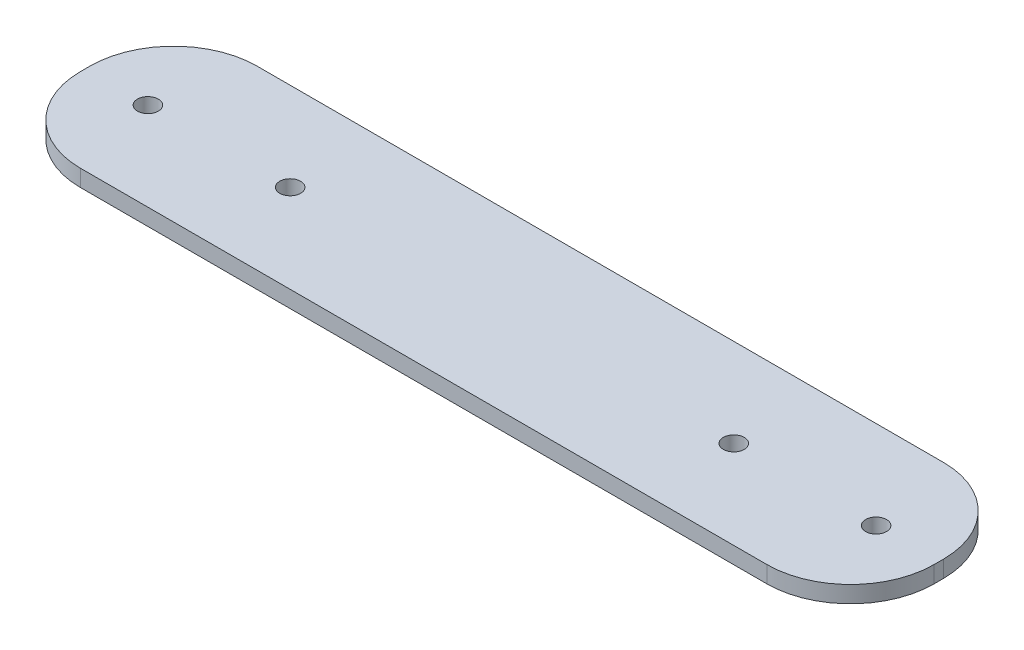
ISO-10303-21;
HEADER;
FILE_DESCRIPTION(('STEP AP214'),'2;1');
FILE_NAME('part.step','',(''),(''),'','','');
FILE_SCHEMA(('AUTOMOTIVE_DESIGN { 1 0 10303 214 1 1 1 1 }'));
ENDSEC;
DATA;
#1=APPLICATION_CONTEXT('core data for automotive mechanical design processes');
#2=APPLICATION_PROTOCOL_DEFINITION('international standard','automotive_design',2000,#1);
#3=PRODUCT_CONTEXT('',#1,'mechanical');
#4=PRODUCT('Part','Part','',(#3));
#5=PRODUCT_RELATED_PRODUCT_CATEGORY('part','',(#4));
#6=PRODUCT_DEFINITION_FORMATION('','',#4);
#7=PRODUCT_DEFINITION_CONTEXT('part definition',#1,'design');
#8=PRODUCT_DEFINITION('design','',#6,#7);
#9=PRODUCT_DEFINITION_SHAPE('','',#8);
#10=(LENGTH_UNIT() NAMED_UNIT(*) SI_UNIT(.MILLI.,.METRE.));
#11=(NAMED_UNIT(*) PLANE_ANGLE_UNIT() SI_UNIT($,.RADIAN.));
#12=(NAMED_UNIT(*) SI_UNIT($,.STERADIAN.) SOLID_ANGLE_UNIT());
#13=UNCERTAINTY_MEASURE_WITH_UNIT(LENGTH_MEASURE(1.E-05),#10,'distance_accuracy_value','');
#14=(GEOMETRIC_REPRESENTATION_CONTEXT(3) GLOBAL_UNCERTAINTY_ASSIGNED_CONTEXT((#13)) GLOBAL_UNIT_ASSIGNED_CONTEXT((#10,
#11,#12)) REPRESENTATION_CONTEXT('',''));
#15=CARTESIAN_POINT('',(0.,0.,0.));
#16=DIRECTION('',(0.,0.,1.));
#17=DIRECTION('',(1.,0.,0.));
#18=AXIS2_PLACEMENT_3D('',#15,#16,#17);
#19=CARTESIAN_POINT('',(0.,2.,0.));
#20=DIRECTION('',(0.,1.,0.));
#21=DIRECTION('',(0.,0.,1.));
#22=AXIS2_PLACEMENT_3D('',#19,#20,#21);
#23=PLANE('',#22);
#24=CARTESIAN_POINT('',(-26.5000000000001,2.,0.));
#25=DIRECTION('',(0.,1.,0.));
#26=DIRECTION('',(0.,0.,1.));
#27=AXIS2_PLACEMENT_3D('',#24,#25,#26);
#28=CIRCLE('',#27,1.25);
#29=CARTESIAN_POINT('',(-26.5000000000001,2.,1.24999999999993));
#30=VERTEX_POINT('',#29);
#31=EDGE_CURVE('E184',#30,#30,#28,.T.);
#32=ORIENTED_EDGE('',*,*,#31,.F.);
#33=EDGE_LOOP('',(#32));
#34=FACE_BOUND('',#33,.T.);
#35=CARTESIAN_POINT('',(43.5,2.,0.));
#36=DIRECTION('',(0.,1.,0.));
#37=DIRECTION('',(0.,0.,1.));
#38=AXIS2_PLACEMENT_3D('',#35,#36,#37);
#39=CIRCLE('',#38,1.24999999999999);
#40=CARTESIAN_POINT('',(43.5,2.,1.24999999999989));
#41=VERTEX_POINT('',#40);
#42=EDGE_CURVE('E168',#41,#41,#39,.T.);
#43=ORIENTED_EDGE('',*,*,#42,.F.);
#44=EDGE_LOOP('',(#43));
#45=FACE_BOUND('',#44,.T.);
#46=DIRECTION('',(0.,0.,-1.));
#47=VECTOR('',#46,1.);
#48=CARTESIAN_POINT('',(51.,2.,-10.5583756345178));
#49=LINE('',#48,#47);
#50=CARTESIAN_POINT('',(51.,2.,0.558375634517773));
#51=VERTEX_POINT('',#50);
#52=CARTESIAN_POINT('',(51.,2.,-0.558375634517773));
#53=VERTEX_POINT('',#52);
#54=EDGE_CURVE('E172',#51,#53,#49,.T.);
#55=ORIENTED_EDGE('',*,*,#54,.T.);
#56=CARTESIAN_POINT('',(41.,2.,-0.558375634517773));
#57=DIRECTION('',(0.,1.,0.));
#58=DIRECTION('',(0.,0.,1.));
#59=AXIS2_PLACEMENT_3D('',#56,#57,#58);
#60=CIRCLE('',#59,10.);
#61=CARTESIAN_POINT('',(41.,2.,-10.5583756345178));
#62=VERTEX_POINT('',#61);
#63=EDGE_CURVE('E149',#53,#62,#60,.T.);
#64=ORIENTED_EDGE('',*,*,#63,.T.);
#65=DIRECTION('',(-1.,0.,0.));
#66=VECTOR('',#65,1.);
#67=CARTESIAN_POINT('',(-51.,2.,-10.5583756345178));
#68=LINE('',#67,#66);
#69=CARTESIAN_POINT('',(-41.,2.,-10.5583756345178));
#70=VERTEX_POINT('',#69);
#71=EDGE_CURVE('E120',#62,#70,#68,.T.);
#72=ORIENTED_EDGE('',*,*,#71,.T.);
#73=CARTESIAN_POINT('',(-41.,2.,-0.558375634517773));
#74=DIRECTION('',(0.,1.,0.));
#75=DIRECTION('',(0.,0.,1.));
#76=AXIS2_PLACEMENT_3D('',#73,#74,#75);
#77=CIRCLE('',#76,10.);
#78=CARTESIAN_POINT('',(-51.,2.,-0.558375634517773));
#79=VERTEX_POINT('',#78);
#80=EDGE_CURVE('E145',#70,#79,#77,.T.);
#81=ORIENTED_EDGE('',*,*,#80,.T.);
#82=DIRECTION('',(0.,0.,1.));
#83=VECTOR('',#82,1.);
#84=CARTESIAN_POINT('',(-51.,2.,-10.5583756345178));
#85=LINE('',#84,#83);
#86=CARTESIAN_POINT('',(-51.,2.,0.558375634517773));
#87=VERTEX_POINT('',#86);
#88=EDGE_CURVE('E128',#79,#87,#85,.T.);
#89=ORIENTED_EDGE('',*,*,#88,.T.);
#90=CARTESIAN_POINT('',(-41.,2.,0.558375634517773));
#91=DIRECTION('',(0.,1.,0.));
#92=DIRECTION('',(0.,0.,1.));
#93=AXIS2_PLACEMENT_3D('',#90,#91,#92);
#94=CIRCLE('',#93,10.);
#95=CARTESIAN_POINT('',(-41.,2.,10.5583756345178));
#96=VERTEX_POINT('',#95);
#97=EDGE_CURVE('E55',#87,#96,#94,.T.);
#98=ORIENTED_EDGE('',*,*,#97,.T.);
#99=DIRECTION('',(1.,0.,0.));
#100=VECTOR('',#99,1.);
#101=CARTESIAN_POINT('',(-51.,2.,10.5583756345178));
#102=LINE('',#101,#100);
#103=CARTESIAN_POINT('',(41.,2.,10.5583756345178));
#104=VERTEX_POINT('',#103);
#105=EDGE_CURVE('E131',#96,#104,#102,.T.);
#106=ORIENTED_EDGE('',*,*,#105,.T.);
#107=CARTESIAN_POINT('',(41.,2.,0.558375634517773));
#108=DIRECTION('',(0.,1.,0.));
#109=DIRECTION('',(0.,0.,1.));
#110=AXIS2_PLACEMENT_3D('',#107,#108,#109);
#111=CIRCLE('',#110,10.);
#112=EDGE_CURVE('E147',#104,#51,#111,.T.);
#113=ORIENTED_EDGE('',*,*,#112,.T.);
#114=EDGE_LOOP('',(#55,#64,#72,#81,#89,#98,#106,#113));
#115=FACE_BOUND('',#114,.T.);
#116=CARTESIAN_POINT('',(26.5,2.,0.));
#117=DIRECTION('',(0.,1.,0.));
#118=DIRECTION('',(0.,0.,1.));
#119=AXIS2_PLACEMENT_3D('',#116,#117,#118);
#120=CIRCLE('',#119,1.24999999999999);
#121=CARTESIAN_POINT('',(26.5,2.,1.2499999999999));
#122=VERTEX_POINT('',#121);
#123=EDGE_CURVE('E178',#122,#122,#120,.T.);
#124=ORIENTED_EDGE('',*,*,#123,.F.);
#125=EDGE_LOOP('',(#124));
#126=FACE_BOUND('',#125,.T.);
#127=CARTESIAN_POINT('',(-43.5000000000001,2.,0.));
#128=DIRECTION('',(0.,1.,0.));
#129=DIRECTION('',(0.,0.,1.));
#130=AXIS2_PLACEMENT_3D('',#127,#128,#129);
#131=CIRCLE('',#130,1.25);
#132=CARTESIAN_POINT('',(-43.5000000000001,2.,1.24999999999993));
#133=VERTEX_POINT('',#132);
#134=EDGE_CURVE('E190',#133,#133,#131,.T.);
#135=ORIENTED_EDGE('',*,*,#134,.F.);
#136=EDGE_LOOP('',(#135));
#137=FACE_BOUND('',#136,.T.);
#138=ADVANCED_FACE('F33',(#34,#45,#115,#126,#137),#23,.T.);
#139=CARTESIAN_POINT('',(0.,0.,0.));
#140=DIRECTION('',(0.,1.,0.));
#141=DIRECTION('',(0.,0.,1.));
#142=AXIS2_PLACEMENT_3D('',#139,#140,#141);
#143=PLANE('',#142);
#144=DIRECTION('',(-1.,0.,0.));
#145=VECTOR('',#144,1.);
#146=CARTESIAN_POINT('',(-51.,0.,-10.5583756345178));
#147=LINE('',#146,#145);
#148=CARTESIAN_POINT('',(41.,0.,-10.5583756345178));
#149=VERTEX_POINT('',#148);
#150=CARTESIAN_POINT('',(-41.,0.,-10.5583756345178));
#151=VERTEX_POINT('',#150);
#152=EDGE_CURVE('E117',#149,#151,#147,.T.);
#153=ORIENTED_EDGE('',*,*,#152,.F.);
#154=CARTESIAN_POINT('',(41.,0.,-0.558375634517773));
#155=DIRECTION('',(0.,1.,0.));
#156=DIRECTION('',(0.,0.,1.));
#157=AXIS2_PLACEMENT_3D('',#154,#155,#156);
#158=CIRCLE('',#157,10.);
#159=CARTESIAN_POINT('',(51.,0.,-0.558375634517773));
#160=VERTEX_POINT('',#159);
#161=EDGE_CURVE('E100',#149,#160,#158,.F.);
#162=ORIENTED_EDGE('',*,*,#161,.T.);
#163=DIRECTION('',(0.,0.,-1.));
#164=VECTOR('',#163,1.);
#165=CARTESIAN_POINT('',(51.,0.,-10.5583756345178));
#166=LINE('',#165,#164);
#167=CARTESIAN_POINT('',(51.,0.,0.558375634517773));
#168=VERTEX_POINT('',#167);
#169=EDGE_CURVE('E129',#168,#160,#166,.T.);
#170=ORIENTED_EDGE('',*,*,#169,.F.);
#171=CARTESIAN_POINT('',(41.,0.,0.558375634517773));
#172=DIRECTION('',(0.,1.,0.));
#173=DIRECTION('',(0.,0.,1.));
#174=AXIS2_PLACEMENT_3D('',#171,#172,#173);
#175=CIRCLE('',#174,10.);
#176=CARTESIAN_POINT('',(41.,0.,10.5583756345178));
#177=VERTEX_POINT('',#176);
#178=EDGE_CURVE('E111',#168,#177,#175,.F.);
#179=ORIENTED_EDGE('',*,*,#178,.T.);
#180=DIRECTION('',(1.,0.,0.));
#181=VECTOR('',#180,1.);
#182=CARTESIAN_POINT('',(-51.,0.,10.5583756345178));
#183=LINE('',#182,#181);
#184=CARTESIAN_POINT('',(-41.,0.,10.5583756345178));
#185=VERTEX_POINT('',#184);
#186=EDGE_CURVE('E133',#185,#177,#183,.T.);
#187=ORIENTED_EDGE('',*,*,#186,.F.);
#188=CARTESIAN_POINT('',(-41.,0.,0.558375634517773));
#189=DIRECTION('',(0.,1.,0.));
#190=DIRECTION('',(0.,0.,1.));
#191=AXIS2_PLACEMENT_3D('',#188,#189,#190);
#192=CIRCLE('',#191,10.);
#193=CARTESIAN_POINT('',(-51.,0.,0.558375634517773));
#194=VERTEX_POINT('',#193);
#195=EDGE_CURVE('E121',#185,#194,#192,.F.);
#196=ORIENTED_EDGE('',*,*,#195,.T.);
#197=DIRECTION('',(0.,0.,1.));
#198=VECTOR('',#197,1.);
#199=CARTESIAN_POINT('',(-51.,0.,-10.5583756345178));
#200=LINE('',#199,#198);
#201=CARTESIAN_POINT('',(-51.,0.,-0.558375634517773));
#202=VERTEX_POINT('',#201);
#203=EDGE_CURVE('E160',#202,#194,#200,.T.);
#204=ORIENTED_EDGE('',*,*,#203,.F.);
#205=CARTESIAN_POINT('',(-41.,0.,-0.558375634517773));
#206=DIRECTION('',(0.,1.,0.));
#207=DIRECTION('',(0.,0.,1.));
#208=AXIS2_PLACEMENT_3D('',#205,#206,#207);
#209=CIRCLE('',#208,10.);
#210=EDGE_CURVE('E127',#202,#151,#209,.F.);
#211=ORIENTED_EDGE('',*,*,#210,.T.);
#212=EDGE_LOOP('',(#153,#162,#170,#179,#187,#196,#204,#211));
#213=FACE_BOUND('',#212,.T.);
#214=CARTESIAN_POINT('',(43.5,0.,0.));
#215=DIRECTION('',(0.,1.,0.));
#216=DIRECTION('',(0.,0.,1.));
#217=AXIS2_PLACEMENT_3D('',#214,#215,#216);
#218=CIRCLE('',#217,1.24999999999999);
#219=CARTESIAN_POINT('',(43.5,0.,1.24999999999989));
#220=VERTEX_POINT('',#219);
#221=EDGE_CURVE('E175',#220,#220,#218,.T.);
#222=ORIENTED_EDGE('',*,*,#221,.T.);
#223=EDGE_LOOP('',(#222));
#224=FACE_BOUND('',#223,.T.);
#225=CARTESIAN_POINT('',(26.5,0.,0.));
#226=DIRECTION('',(0.,1.,0.));
#227=DIRECTION('',(0.,0.,1.));
#228=AXIS2_PLACEMENT_3D('',#225,#226,#227);
#229=CIRCLE('',#228,1.24999999999999);
#230=CARTESIAN_POINT('',(26.5,0.,1.2499999999999));
#231=VERTEX_POINT('',#230);
#232=EDGE_CURVE('E181',#231,#231,#229,.T.);
#233=ORIENTED_EDGE('',*,*,#232,.T.);
#234=EDGE_LOOP('',(#233));
#235=FACE_BOUND('',#234,.T.);
#236=CARTESIAN_POINT('',(-26.5000000000001,0.,0.));
#237=DIRECTION('',(0.,1.,0.));
#238=DIRECTION('',(0.,0.,1.));
#239=AXIS2_PLACEMENT_3D('',#236,#237,#238);
#240=CIRCLE('',#239,1.25);
#241=CARTESIAN_POINT('',(-26.5000000000001,0.,1.24999999999993));
#242=VERTEX_POINT('',#241);
#243=EDGE_CURVE('E187',#242,#242,#240,.T.);
#244=ORIENTED_EDGE('',*,*,#243,.T.);
#245=EDGE_LOOP('',(#244));
#246=FACE_BOUND('',#245,.T.);
#247=CARTESIAN_POINT('',(-43.5000000000001,0.,0.));
#248=DIRECTION('',(0.,1.,0.));
#249=DIRECTION('',(0.,0.,1.));
#250=AXIS2_PLACEMENT_3D('',#247,#248,#249);
#251=CIRCLE('',#250,1.25);
#252=CARTESIAN_POINT('',(-43.5000000000001,0.,1.24999999999993));
#253=VERTEX_POINT('',#252);
#254=EDGE_CURVE('E193',#253,#253,#251,.T.);
#255=ORIENTED_EDGE('',*,*,#254,.T.);
#256=EDGE_LOOP('',(#255));
#257=FACE_BOUND('',#256,.T.);
#258=ADVANCED_FACE('F124',(#213,#224,#235,#246,#257),#143,.F.);
#259=CARTESIAN_POINT('',(-51.,2.,-10.5583756345178));
#260=DIRECTION('',(1.,0.,0.));
#261=DIRECTION('',(0.,0.,-1.));
#262=AXIS2_PLACEMENT_3D('',#259,#260,#261);
#263=PLANE('',#262);
#264=ORIENTED_EDGE('',*,*,#88,.F.);
#265=DIRECTION('',(0.,-1.,0.));
#266=VECTOR('',#265,1.);
#267=CARTESIAN_POINT('',(-51.,2.,-0.558375634517773));
#268=LINE('',#267,#266);
#269=EDGE_CURVE('E11',#79,#202,#268,.T.);
#270=ORIENTED_EDGE('',*,*,#269,.T.);
#271=ORIENTED_EDGE('',*,*,#203,.T.);
#272=DIRECTION('',(0.,-1.,0.));
#273=VECTOR('',#272,1.);
#274=CARTESIAN_POINT('',(-51.,2.,0.558375634517773));
#275=LINE('',#274,#273);
#276=EDGE_CURVE('E41',#194,#87,#275,.F.);
#277=ORIENTED_EDGE('',*,*,#276,.T.);
#278=EDGE_LOOP('',(#264,#270,#271,#277));
#279=FACE_BOUND('',#278,.T.);
#280=ADVANCED_FACE('F158',(#279),#263,.F.);
#281=CARTESIAN_POINT('',(-51.,2.,10.5583756345178));
#282=DIRECTION('',(0.,0.,-1.));
#283=DIRECTION('',(-1.,0.,0.));
#284=AXIS2_PLACEMENT_3D('',#281,#282,#283);
#285=PLANE('',#284);
#286=ORIENTED_EDGE('',*,*,#186,.T.);
#287=DIRECTION('',(0.,-1.,0.));
#288=VECTOR('',#287,1.);
#289=CARTESIAN_POINT('',(41.,2.,10.5583756345178));
#290=LINE('',#289,#288);
#291=EDGE_CURVE('E48',#177,#104,#290,.F.);
#292=ORIENTED_EDGE('',*,*,#291,.T.);
#293=ORIENTED_EDGE('',*,*,#105,.F.);
#294=DIRECTION('',(0.,-1.,0.));
#295=VECTOR('',#294,1.);
#296=CARTESIAN_POINT('',(-41.,2.,10.5583756345178));
#297=LINE('',#296,#295);
#298=EDGE_CURVE('E151',#96,#185,#297,.T.);
#299=ORIENTED_EDGE('',*,*,#298,.T.);
#300=EDGE_LOOP('',(#286,#292,#293,#299));
#301=FACE_BOUND('',#300,.T.);
#302=ADVANCED_FACE('F167',(#301),#285,.F.);
#303=CARTESIAN_POINT('',(51.,2.,-10.5583756345178));
#304=DIRECTION('',(-1.,0.,0.));
#305=DIRECTION('',(0.,0.,1.));
#306=AXIS2_PLACEMENT_3D('',#303,#304,#305);
#307=PLANE('',#306);
#308=ORIENTED_EDGE('',*,*,#169,.T.);
#309=DIRECTION('',(0.,-1.,0.));
#310=VECTOR('',#309,1.);
#311=CARTESIAN_POINT('',(51.,2.,-0.558375634517773));
#312=LINE('',#311,#310);
#313=EDGE_CURVE('E105',#160,#53,#312,.F.);
#314=ORIENTED_EDGE('',*,*,#313,.T.);
#315=ORIENTED_EDGE('',*,*,#54,.F.);
#316=DIRECTION('',(0.,-1.,0.));
#317=VECTOR('',#316,1.);
#318=CARTESIAN_POINT('',(51.,2.,0.558375634517773));
#319=LINE('',#318,#317);
#320=EDGE_CURVE('E110',#51,#168,#319,.T.);
#321=ORIENTED_EDGE('',*,*,#320,.T.);
#322=EDGE_LOOP('',(#308,#314,#315,#321));
#323=FACE_BOUND('',#322,.T.);
#324=ADVANCED_FACE('F217',(#323),#307,.F.);
#325=CARTESIAN_POINT('',(-51.,2.,-10.5583756345178));
#326=DIRECTION('',(0.,0.,1.));
#327=DIRECTION('',(1.,0.,0.));
#328=AXIS2_PLACEMENT_3D('',#325,#326,#327);
#329=PLANE('',#328);
#330=ORIENTED_EDGE('',*,*,#71,.F.);
#331=DIRECTION('',(0.,-1.,0.));
#332=VECTOR('',#331,1.);
#333=CARTESIAN_POINT('',(41.,2.,-10.5583756345178));
#334=LINE('',#333,#332);
#335=EDGE_CURVE('E104',#62,#149,#334,.T.);
#336=ORIENTED_EDGE('',*,*,#335,.T.);
#337=ORIENTED_EDGE('',*,*,#152,.T.);
#338=DIRECTION('',(0.,-1.,0.));
#339=VECTOR('',#338,1.);
#340=CARTESIAN_POINT('',(-41.,2.,-10.5583756345178));
#341=LINE('',#340,#339);
#342=EDGE_CURVE('E122',#151,#70,#341,.F.);
#343=ORIENTED_EDGE('',*,*,#342,.T.);
#344=EDGE_LOOP('',(#330,#336,#337,#343));
#345=FACE_BOUND('',#344,.T.);
#346=ADVANCED_FACE('F116',(#345),#329,.F.);
#347=CARTESIAN_POINT('',(43.5,2.,0.));
#348=DIRECTION('',(0.,-1.,0.));
#349=DIRECTION('',(0.,0.,-1.));
#350=AXIS2_PLACEMENT_3D('',#347,#348,#349);
#351=CYLINDRICAL_SURFACE('',#350,1.24999999999999);
#352=ORIENTED_EDGE('',*,*,#42,.T.);
#353=EDGE_LOOP('',(#352));
#354=FACE_BOUND('',#353,.T.);
#355=ORIENTED_EDGE('',*,*,#221,.F.);
#356=EDGE_LOOP('',(#355));
#357=FACE_BOUND('',#356,.T.);
#358=ADVANCED_FACE('F212',(#354,#357),#351,.F.);
#359=CARTESIAN_POINT('',(26.5,2.,0.));
#360=DIRECTION('',(0.,-1.,0.));
#361=DIRECTION('',(0.,0.,-1.));
#362=AXIS2_PLACEMENT_3D('',#359,#360,#361);
#363=CYLINDRICAL_SURFACE('',#362,1.24999999999999);
#364=ORIENTED_EDGE('',*,*,#123,.T.);
#365=EDGE_LOOP('',(#364));
#366=FACE_BOUND('',#365,.T.);
#367=ORIENTED_EDGE('',*,*,#232,.F.);
#368=EDGE_LOOP('',(#367));
#369=FACE_BOUND('',#368,.T.);
#370=ADVANCED_FACE('F311',(#366,#369),#363,.F.);
#371=CARTESIAN_POINT('',(-26.5000000000001,2.,0.));
#372=DIRECTION('',(0.,-1.,0.));
#373=DIRECTION('',(0.,0.,-1.));
#374=AXIS2_PLACEMENT_3D('',#371,#372,#373);
#375=CYLINDRICAL_SURFACE('',#374,1.25);
#376=ORIENTED_EDGE('',*,*,#31,.T.);
#377=EDGE_LOOP('',(#376));
#378=FACE_BOUND('',#377,.T.);
#379=ORIENTED_EDGE('',*,*,#243,.F.);
#380=EDGE_LOOP('',(#379));
#381=FACE_BOUND('',#380,.T.);
#382=ADVANCED_FACE('F302',(#378,#381),#375,.F.);
#383=CARTESIAN_POINT('',(-43.5000000000001,2.,0.));
#384=DIRECTION('',(0.,-1.,0.));
#385=DIRECTION('',(0.,0.,-1.));
#386=AXIS2_PLACEMENT_3D('',#383,#384,#385);
#387=CYLINDRICAL_SURFACE('',#386,1.25);
#388=ORIENTED_EDGE('',*,*,#134,.T.);
#389=EDGE_LOOP('',(#388));
#390=FACE_BOUND('',#389,.T.);
#391=ORIENTED_EDGE('',*,*,#254,.F.);
#392=EDGE_LOOP('',(#391));
#393=FACE_BOUND('',#392,.T.);
#394=ADVANCED_FACE('F199',(#390,#393),#387,.F.);
#395=CARTESIAN_POINT('',(41.,2.,-0.558375634517773));
#396=DIRECTION('',(0.,-1.,0.));
#397=DIRECTION('',(0.,0.,-1.));
#398=AXIS2_PLACEMENT_3D('',#395,#396,#397);
#399=CYLINDRICAL_SURFACE('',#398,10.);
#400=ORIENTED_EDGE('',*,*,#63,.F.);
#401=ORIENTED_EDGE('',*,*,#313,.F.);
#402=ORIENTED_EDGE('',*,*,#161,.F.);
#403=ORIENTED_EDGE('',*,*,#335,.F.);
#404=EDGE_LOOP('',(#400,#401,#402,#403));
#405=FACE_BOUND('',#404,.T.);
#406=ADVANCED_FACE('F103',(#405),#399,.T.);
#407=CARTESIAN_POINT('',(41.,2.,0.558375634517773));
#408=DIRECTION('',(0.,-1.,0.));
#409=DIRECTION('',(0.,0.,-1.));
#410=AXIS2_PLACEMENT_3D('',#407,#408,#409);
#411=CYLINDRICAL_SURFACE('',#410,10.);
#412=ORIENTED_EDGE('',*,*,#112,.F.);
#413=ORIENTED_EDGE('',*,*,#291,.F.);
#414=ORIENTED_EDGE('',*,*,#178,.F.);
#415=ORIENTED_EDGE('',*,*,#320,.F.);
#416=EDGE_LOOP('',(#412,#413,#414,#415));
#417=FACE_BOUND('',#416,.T.);
#418=ADVANCED_FACE('F227',(#417),#411,.T.);
#419=CARTESIAN_POINT('',(-41.,2.,-0.558375634517773));
#420=DIRECTION('',(0.,-1.,0.));
#421=DIRECTION('',(0.,0.,-1.));
#422=AXIS2_PLACEMENT_3D('',#419,#420,#421);
#423=CYLINDRICAL_SURFACE('',#422,10.);
#424=ORIENTED_EDGE('',*,*,#80,.F.);
#425=ORIENTED_EDGE('',*,*,#342,.F.);
#426=ORIENTED_EDGE('',*,*,#210,.F.);
#427=ORIENTED_EDGE('',*,*,#269,.F.);
#428=EDGE_LOOP('',(#424,#425,#426,#427));
#429=FACE_BOUND('',#428,.T.);
#430=ADVANCED_FACE('F229',(#429),#423,.T.);
#431=CARTESIAN_POINT('',(-41.,2.,0.558375634517773));
#432=DIRECTION('',(0.,-1.,0.));
#433=DIRECTION('',(0.,0.,-1.));
#434=AXIS2_PLACEMENT_3D('',#431,#432,#433);
#435=CYLINDRICAL_SURFACE('',#434,10.);
#436=ORIENTED_EDGE('',*,*,#97,.F.);
#437=ORIENTED_EDGE('',*,*,#276,.F.);
#438=ORIENTED_EDGE('',*,*,#195,.F.);
#439=ORIENTED_EDGE('',*,*,#298,.F.);
#440=EDGE_LOOP('',(#436,#437,#438,#439));
#441=FACE_BOUND('',#440,.T.);
#442=ADVANCED_FACE('F35',(#441),#435,.T.);
#443=CLOSED_SHELL('',(#138,#258,#280,#302,#324,#346,#358,#370,#382,#394,#406,#418,#430,#442));
#444=MANIFOLD_SOLID_BREP('B2',#443);
#445=ADVANCED_BREP_SHAPE_REPRESENTATION('',(#18,#444),#14);
#446=SHAPE_DEFINITION_REPRESENTATION(#9,#445);
ENDSEC;
END-ISO-10303-21;
